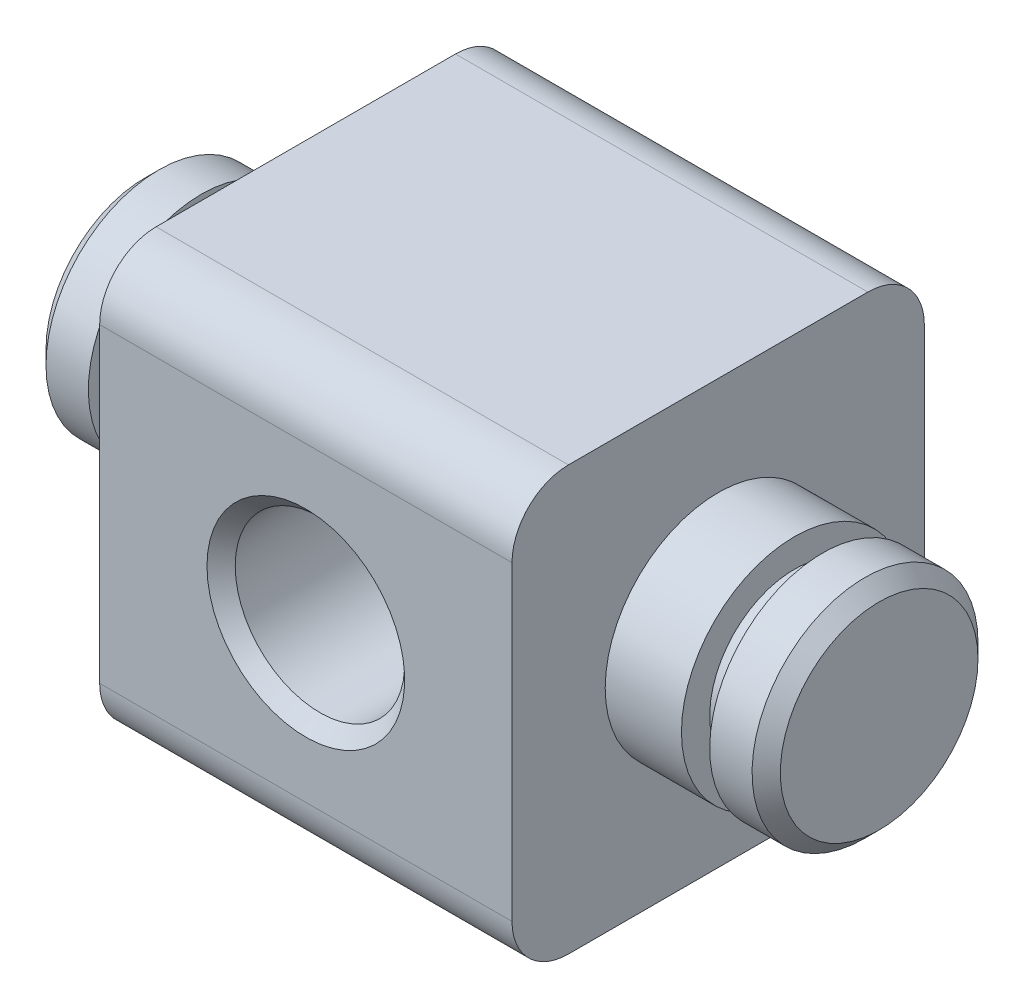
ISO-10303-21;
HEADER;
FILE_DESCRIPTION(('STEP AP214'),'2;1');
FILE_NAME('part.step','',(''),(''),'','','');
FILE_SCHEMA(('AUTOMOTIVE_DESIGN { 1 0 10303 214 1 1 1 1 }'));
ENDSEC;
DATA;
#1=APPLICATION_CONTEXT('core data for automotive mechanical design processes');
#2=APPLICATION_PROTOCOL_DEFINITION('international standard','automotive_design',2000,#1);
#3=PRODUCT_CONTEXT('',#1,'mechanical');
#4=PRODUCT('Part','Part','',(#3));
#5=PRODUCT_RELATED_PRODUCT_CATEGORY('part','',(#4));
#6=PRODUCT_DEFINITION_FORMATION('','',#4);
#7=PRODUCT_DEFINITION_CONTEXT('part definition',#1,'design');
#8=PRODUCT_DEFINITION('design','',#6,#7);
#9=PRODUCT_DEFINITION_SHAPE('','',#8);
#10=(LENGTH_UNIT() NAMED_UNIT(*) SI_UNIT(.MILLI.,.METRE.));
#11=(NAMED_UNIT(*) PLANE_ANGLE_UNIT() SI_UNIT($,.RADIAN.));
#12=(NAMED_UNIT(*) SI_UNIT($,.STERADIAN.) SOLID_ANGLE_UNIT());
#13=UNCERTAINTY_MEASURE_WITH_UNIT(LENGTH_MEASURE(1.E-05),#10,'distance_accuracy_value','');
#14=(GEOMETRIC_REPRESENTATION_CONTEXT(3) GLOBAL_UNCERTAINTY_ASSIGNED_CONTEXT((#13)) GLOBAL_UNIT_ASSIGNED_CONTEXT((#10,
#11,#12)) REPRESENTATION_CONTEXT('',''));
#15=CARTESIAN_POINT('',(0.,0.,0.));
#16=DIRECTION('',(0.,0.,1.));
#17=DIRECTION('',(1.,0.,0.));
#18=AXIS2_PLACEMENT_3D('',#15,#16,#17);
#19=CARTESIAN_POINT('',(13.,7.5,0.));
#20=DIRECTION('',(-1.,0.,0.));
#21=DIRECTION('',(0.,0.,1.));
#22=AXIS2_PLACEMENT_3D('',#19,#20,#21);
#23=CYLINDRICAL_SURFACE('',#22,4.);
#24=CARTESIAN_POINT('',(7.3,7.5,0.));
#25=DIRECTION('',(-1.,0.,0.));
#26=DIRECTION('',(0.,0.,1.));
#27=AXIS2_PLACEMENT_3D('',#24,#25,#26);
#28=CIRCLE('',#27,4.);
#29=CARTESIAN_POINT('',(7.3,7.5,4.));
#30=VERTEX_POINT('',#29);
#31=EDGE_CURVE('E207',#30,#30,#28,.T.);
#32=ORIENTED_EDGE('',*,*,#31,.F.);
#33=EDGE_LOOP('',(#32));
#34=FACE_BOUND('',#33,.T.);
#35=CARTESIAN_POINT('',(10.,7.5,0.));
#36=DIRECTION('',(1.,0.,0.));
#37=DIRECTION('',(0.,1.,0.));
#38=AXIS2_PLACEMENT_3D('',#35,#36,#37);
#39=CIRCLE('',#38,4.);
#40=CARTESIAN_POINT('',(10.,11.5,0.));
#41=VERTEX_POINT('',#40);
#42=EDGE_CURVE('E201',#41,#41,#39,.F.);
#43=ORIENTED_EDGE('',*,*,#42,.T.);
#44=EDGE_LOOP('',(#43));
#45=FACE_BOUND('',#44,.T.);
#46=ADVANCED_FACE('F34',(#34,#45),#23,.T.);
#47=CARTESIAN_POINT('',(-13.,7.5,0.));
#48=DIRECTION('',(1.,0.,0.));
#49=DIRECTION('',(0.,0.,-1.));
#50=AXIS2_PLACEMENT_3D('',#47,#48,#49);
#51=CYLINDRICAL_SURFACE('',#50,4.);
#52=CARTESIAN_POINT('',(-7.3,7.5,0.));
#53=DIRECTION('',(-1.,0.,0.));
#54=DIRECTION('',(0.,0.,1.));
#55=AXIS2_PLACEMENT_3D('',#52,#53,#54);
#56=CIRCLE('',#55,4.);
#57=CARTESIAN_POINT('',(-7.3,7.5,4.));
#58=VERTEX_POINT('',#57);
#59=EDGE_CURVE('E188',#58,#58,#56,.T.);
#60=ORIENTED_EDGE('',*,*,#59,.T.);
#61=EDGE_LOOP('',(#60));
#62=FACE_BOUND('',#61,.T.);
#63=CARTESIAN_POINT('',(-10.,7.5,0.));
#64=DIRECTION('',(-1.,0.,0.));
#65=DIRECTION('',(0.,-1.,0.));
#66=AXIS2_PLACEMENT_3D('',#63,#64,#65);
#67=CIRCLE('',#66,4.);
#68=CARTESIAN_POINT('',(-10.,3.5,0.));
#69=VERTEX_POINT('',#68);
#70=EDGE_CURVE('E189',#69,#69,#67,.T.);
#71=ORIENTED_EDGE('',*,*,#70,.F.);
#72=EDGE_LOOP('',(#71));
#73=FACE_BOUND('',#72,.T.);
#74=ADVANCED_FACE('F231',(#62,#73),#51,.T.);
#75=CARTESIAN_POINT('',(-7.3,15.,7.3));
#76=DIRECTION('',(1.,0.,0.));
#77=DIRECTION('',(0.,0.,-1.));
#78=AXIS2_PLACEMENT_3D('',#75,#76,#77);
#79=PLANE('',#78);
#80=ORIENTED_EDGE('',*,*,#59,.F.);
#81=EDGE_LOOP('',(#80));
#82=FACE_BOUND('',#81,.T.);
#83=DIRECTION('',(0.,-1.,0.));
#84=VECTOR('',#83,1.);
#85=CARTESIAN_POINT('',(-7.3,15.,-7.3));
#86=LINE('',#85,#84);
#87=CARTESIAN_POINT('',(-7.3,13.,-7.3));
#88=VERTEX_POINT('',#87);
#89=CARTESIAN_POINT('',(-7.3,2.,-7.3));
#90=VERTEX_POINT('',#89);
#91=EDGE_CURVE('E104',#88,#90,#86,.T.);
#92=ORIENTED_EDGE('',*,*,#91,.T.);
#93=CARTESIAN_POINT('',(-7.3,2.,-5.3));
#94=DIRECTION('',(1.,0.,0.));
#95=DIRECTION('',(0.,0.,-1.));
#96=AXIS2_PLACEMENT_3D('',#93,#94,#95);
#97=CIRCLE('',#96,2.);
#98=CARTESIAN_POINT('',(-7.3,0.,-5.3));
#99=VERTEX_POINT('',#98);
#100=EDGE_CURVE('E137',#90,#99,#97,.F.);
#101=ORIENTED_EDGE('',*,*,#100,.T.);
#102=DIRECTION('',(0.,0.,1.));
#103=VECTOR('',#102,1.);
#104=CARTESIAN_POINT('',(-7.3,0.,7.3));
#105=LINE('',#104,#103);
#106=CARTESIAN_POINT('',(-7.3,0.,5.3));
#107=VERTEX_POINT('',#106);
#108=EDGE_CURVE('E165',#99,#107,#105,.T.);
#109=ORIENTED_EDGE('',*,*,#108,.T.);
#110=CARTESIAN_POINT('',(-7.3,2.,5.3));
#111=DIRECTION('',(1.,0.,0.));
#112=DIRECTION('',(0.,0.,-1.));
#113=AXIS2_PLACEMENT_3D('',#110,#111,#112);
#114=CIRCLE('',#113,2.);
#115=CARTESIAN_POINT('',(-7.3,2.,7.3));
#116=VERTEX_POINT('',#115);
#117=EDGE_CURVE('E110',#107,#116,#114,.F.);
#118=ORIENTED_EDGE('',*,*,#117,.T.);
#119=DIRECTION('',(0.,-1.,0.));
#120=VECTOR('',#119,1.);
#121=CARTESIAN_POINT('',(-7.3,15.,7.3));
#122=LINE('',#121,#120);
#123=CARTESIAN_POINT('',(-7.3,13.,7.3));
#124=VERTEX_POINT('',#123);
#125=EDGE_CURVE('E173',#124,#116,#122,.T.);
#126=ORIENTED_EDGE('',*,*,#125,.F.);
#127=CARTESIAN_POINT('',(-7.3,13.,5.3));
#128=DIRECTION('',(1.,0.,0.));
#129=DIRECTION('',(0.,0.,-1.));
#130=AXIS2_PLACEMENT_3D('',#127,#128,#129);
#131=CIRCLE('',#130,2.);
#132=CARTESIAN_POINT('',(-7.3,15.,5.3));
#133=VERTEX_POINT('',#132);
#134=EDGE_CURVE('E111',#124,#133,#131,.F.);
#135=ORIENTED_EDGE('',*,*,#134,.T.);
#136=DIRECTION('',(0.,0.,1.));
#137=VECTOR('',#136,1.);
#138=CARTESIAN_POINT('',(-7.3,15.,7.3));
#139=LINE('',#138,#137);
#140=CARTESIAN_POINT('',(-7.3,15.,-5.3));
#141=VERTEX_POINT('',#140);
#142=EDGE_CURVE('E106',#141,#133,#139,.T.);
#143=ORIENTED_EDGE('',*,*,#142,.F.);
#144=CARTESIAN_POINT('',(-7.3,13.,-5.3));
#145=DIRECTION('',(1.,0.,0.));
#146=DIRECTION('',(0.,0.,-1.));
#147=AXIS2_PLACEMENT_3D('',#144,#145,#146);
#148=CIRCLE('',#147,2.);
#149=EDGE_CURVE('E101',#141,#88,#148,.F.);
#150=ORIENTED_EDGE('',*,*,#149,.T.);
#151=EDGE_LOOP('',(#92,#101,#109,#118,#126,#135,#143,#150));
#152=FACE_BOUND('',#151,.T.);
#153=ADVANCED_FACE('F103',(#82,#152),#79,.F.);
#154=CARTESIAN_POINT('',(7.3,15.,7.3));
#155=DIRECTION('',(0.,0.,-1.));
#156=DIRECTION('',(-1.,0.,0.));
#157=AXIS2_PLACEMENT_3D('',#154,#155,#156);
#158=PLANE('',#157);
#159=CARTESIAN_POINT('',(0.,7.5,7.3));
#160=DIRECTION('',(0.,0.,-1.));
#161=DIRECTION('',(-1.,0.,0.));
#162=AXIS2_PLACEMENT_3D('',#159,#160,#161);
#163=CIRCLE('',#162,3.5);
#164=CARTESIAN_POINT('',(-3.5,7.5,7.3));
#165=VERTEX_POINT('',#164);
#166=EDGE_CURVE('E185',#165,#165,#163,.T.);
#167=ORIENTED_EDGE('',*,*,#166,.T.);
#168=EDGE_LOOP('',(#167));
#169=FACE_BOUND('',#168,.T.);
#170=ORIENTED_EDGE('',*,*,#125,.T.);
#171=DIRECTION('',(1.,0.,0.));
#172=VECTOR('',#171,1.);
#173=CARTESIAN_POINT('',(7.3,2.,7.3));
#174=LINE('',#173,#172);
#175=CARTESIAN_POINT('',(7.3,2.,7.3));
#176=VERTEX_POINT('',#175);
#177=EDGE_CURVE('E150',#116,#176,#174,.T.);
#178=ORIENTED_EDGE('',*,*,#177,.T.);
#179=DIRECTION('',(0.,-1.,0.));
#180=VECTOR('',#179,1.);
#181=CARTESIAN_POINT('',(7.3,15.,7.3));
#182=LINE('',#181,#180);
#183=CARTESIAN_POINT('',(7.3,13.,7.3));
#184=VERTEX_POINT('',#183);
#185=EDGE_CURVE('E171',#184,#176,#182,.T.);
#186=ORIENTED_EDGE('',*,*,#185,.F.);
#187=DIRECTION('',(1.,0.,0.));
#188=VECTOR('',#187,1.);
#189=CARTESIAN_POINT('',(-7.3,13.,7.3));
#190=LINE('',#189,#188);
#191=EDGE_CURVE('E148',#184,#124,#190,.F.);
#192=ORIENTED_EDGE('',*,*,#191,.T.);
#193=EDGE_LOOP('',(#170,#178,#186,#192));
#194=FACE_BOUND('',#193,.T.);
#195=ADVANCED_FACE('F280',(#169,#194),#158,.F.);
#196=CARTESIAN_POINT('',(7.3,15.,7.3));
#197=DIRECTION('',(-1.,0.,0.));
#198=DIRECTION('',(0.,0.,1.));
#199=AXIS2_PLACEMENT_3D('',#196,#197,#198);
#200=PLANE('',#199);
#201=ORIENTED_EDGE('',*,*,#31,.T.);
#202=EDGE_LOOP('',(#201));
#203=FACE_BOUND('',#202,.T.);
#204=DIRECTION('',(0.,0.,-1.));
#205=VECTOR('',#204,1.);
#206=CARTESIAN_POINT('',(7.3,0.,7.3));
#207=LINE('',#206,#205);
#208=CARTESIAN_POINT('',(7.3,0.,5.3));
#209=VERTEX_POINT('',#208);
#210=CARTESIAN_POINT('',(7.3,0.,-5.3));
#211=VERTEX_POINT('',#210);
#212=EDGE_CURVE('E161',#209,#211,#207,.T.);
#213=ORIENTED_EDGE('',*,*,#212,.T.);
#214=CARTESIAN_POINT('',(7.3,2.,-5.3));
#215=DIRECTION('',(-1.,0.,0.));
#216=DIRECTION('',(0.,0.,1.));
#217=AXIS2_PLACEMENT_3D('',#214,#215,#216);
#218=CIRCLE('',#217,2.);
#219=CARTESIAN_POINT('',(7.3,2.,-7.3));
#220=VERTEX_POINT('',#219);
#221=EDGE_CURVE('E146',#211,#220,#218,.F.);
#222=ORIENTED_EDGE('',*,*,#221,.T.);
#223=DIRECTION('',(0.,-1.,0.));
#224=VECTOR('',#223,1.);
#225=CARTESIAN_POINT('',(7.3,15.,-7.3));
#226=LINE('',#225,#224);
#227=CARTESIAN_POINT('',(7.3,13.,-7.3));
#228=VERTEX_POINT('',#227);
#229=EDGE_CURVE('E121',#228,#220,#226,.T.);
#230=ORIENTED_EDGE('',*,*,#229,.F.);
#231=CARTESIAN_POINT('',(7.3,13.,-5.3));
#232=DIRECTION('',(-1.,0.,0.));
#233=DIRECTION('',(0.,0.,1.));
#234=AXIS2_PLACEMENT_3D('',#231,#232,#233);
#235=CIRCLE('',#234,2.);
#236=CARTESIAN_POINT('',(7.3,15.,-5.3));
#237=VERTEX_POINT('',#236);
#238=EDGE_CURVE('E126',#228,#237,#235,.F.);
#239=ORIENTED_EDGE('',*,*,#238,.T.);
#240=DIRECTION('',(0.,0.,-1.));
#241=VECTOR('',#240,1.);
#242=CARTESIAN_POINT('',(7.3,15.,7.3));
#243=LINE('',#242,#241);
#244=CARTESIAN_POINT('',(7.3,15.,5.3));
#245=VERTEX_POINT('',#244);
#246=EDGE_CURVE('E122',#245,#237,#243,.T.);
#247=ORIENTED_EDGE('',*,*,#246,.F.);
#248=CARTESIAN_POINT('',(7.3,13.,5.3));
#249=DIRECTION('',(-1.,0.,0.));
#250=DIRECTION('',(0.,0.,1.));
#251=AXIS2_PLACEMENT_3D('',#248,#249,#250);
#252=CIRCLE('',#251,2.);
#253=EDGE_CURVE('E57',#245,#184,#252,.F.);
#254=ORIENTED_EDGE('',*,*,#253,.T.);
#255=ORIENTED_EDGE('',*,*,#185,.T.);
#256=CARTESIAN_POINT('',(7.3,2.,5.3));
#257=DIRECTION('',(-1.,0.,0.));
#258=DIRECTION('',(0.,0.,1.));
#259=AXIS2_PLACEMENT_3D('',#256,#257,#258);
#260=CIRCLE('',#259,2.);
#261=EDGE_CURVE('E49',#176,#209,#260,.F.);
#262=ORIENTED_EDGE('',*,*,#261,.T.);
#263=EDGE_LOOP('',(#213,#222,#230,#239,#247,#254,#255,#262));
#264=FACE_BOUND('',#263,.T.);
#265=ADVANCED_FACE('F159',(#203,#264),#200,.F.);
#266=CARTESIAN_POINT('',(7.3,15.,-7.3));
#267=DIRECTION('',(0.,0.,1.));
#268=DIRECTION('',(1.,0.,0.));
#269=AXIS2_PLACEMENT_3D('',#266,#267,#268);
#270=PLANE('',#269);
#271=CARTESIAN_POINT('',(0.,7.5,-7.3));
#272=DIRECTION('',(0.,0.,1.));
#273=DIRECTION('',(1.,0.,0.));
#274=AXIS2_PLACEMENT_3D('',#271,#272,#273);
#275=CIRCLE('',#274,3.5);
#276=CARTESIAN_POINT('',(3.5,7.5,-7.3));
#277=VERTEX_POINT('',#276);
#278=EDGE_CURVE('E176',#277,#277,#275,.T.);
#279=ORIENTED_EDGE('',*,*,#278,.T.);
#280=EDGE_LOOP('',(#279));
#281=FACE_BOUND('',#280,.T.);
#282=ORIENTED_EDGE('',*,*,#229,.T.);
#283=DIRECTION('',(-1.,0.,0.));
#284=VECTOR('',#283,1.);
#285=CARTESIAN_POINT('',(7.3,2.,-7.3));
#286=LINE('',#285,#284);
#287=EDGE_CURVE('E120',#220,#90,#286,.T.);
#288=ORIENTED_EDGE('',*,*,#287,.T.);
#289=ORIENTED_EDGE('',*,*,#91,.F.);
#290=DIRECTION('',(-1.,0.,0.));
#291=VECTOR('',#290,1.);
#292=CARTESIAN_POINT('',(7.3,13.,-7.3));
#293=LINE('',#292,#291);
#294=EDGE_CURVE('E117',#88,#228,#293,.F.);
#295=ORIENTED_EDGE('',*,*,#294,.T.);
#296=EDGE_LOOP('',(#282,#288,#289,#295));
#297=FACE_BOUND('',#296,.T.);
#298=ADVANCED_FACE('F116',(#281,#297),#270,.F.);
#299=CARTESIAN_POINT('',(0.,15.,0.));
#300=DIRECTION('',(0.,1.,0.));
#301=DIRECTION('',(0.,0.,1.));
#302=AXIS2_PLACEMENT_3D('',#299,#300,#301);
#303=PLANE('',#302);
#304=ORIENTED_EDGE('',*,*,#246,.T.);
#305=DIRECTION('',(-1.,0.,0.));
#306=VECTOR('',#305,1.);
#307=CARTESIAN_POINT('',(-7.3,15.,-5.3));
#308=LINE('',#307,#306);
#309=EDGE_CURVE('E11',#237,#141,#308,.T.);
#310=ORIENTED_EDGE('',*,*,#309,.T.);
#311=ORIENTED_EDGE('',*,*,#142,.T.);
#312=DIRECTION('',(1.,0.,0.));
#313=VECTOR('',#312,1.);
#314=CARTESIAN_POINT('',(7.3,15.,5.3));
#315=LINE('',#314,#313);
#316=EDGE_CURVE('E42',#133,#245,#315,.T.);
#317=ORIENTED_EDGE('',*,*,#316,.T.);
#318=EDGE_LOOP('',(#304,#310,#311,#317));
#319=FACE_BOUND('',#318,.T.);
#320=ADVANCED_FACE('F155',(#319),#303,.T.);
#321=CARTESIAN_POINT('',(0.,0.,0.));
#322=DIRECTION('',(0.,1.,0.));
#323=DIRECTION('',(0.,0.,1.));
#324=AXIS2_PLACEMENT_3D('',#321,#322,#323);
#325=PLANE('',#324);
#326=ORIENTED_EDGE('',*,*,#108,.F.);
#327=DIRECTION('',(-1.,0.,0.));
#328=VECTOR('',#327,1.);
#329=CARTESIAN_POINT('',(0.,0.,-5.3));
#330=LINE('',#329,#328);
#331=EDGE_CURVE('E141',#99,#211,#330,.F.);
#332=ORIENTED_EDGE('',*,*,#331,.T.);
#333=ORIENTED_EDGE('',*,*,#212,.F.);
#334=DIRECTION('',(1.,0.,0.));
#335=VECTOR('',#334,1.);
#336=CARTESIAN_POINT('',(0.,0.,5.3));
#337=LINE('',#336,#335);
#338=EDGE_CURVE('E139',#209,#107,#337,.F.);
#339=ORIENTED_EDGE('',*,*,#338,.T.);
#340=EDGE_LOOP('',(#326,#332,#333,#339));
#341=FACE_BOUND('',#340,.T.);
#342=ADVANCED_FACE('F268',(#341),#325,.F.);
#343=CARTESIAN_POINT('',(0.,7.5,7.3));
#344=DIRECTION('',(0.,0.,-1.));
#345=DIRECTION('',(-1.,0.,0.));
#346=AXIS2_PLACEMENT_3D('',#343,#344,#345);
#347=CYLINDRICAL_SURFACE('',#346,3.);
#348=CARTESIAN_POINT('',(0.,7.5,-6.8));
#349=DIRECTION('',(0.,0.,1.));
#350=DIRECTION('',(1.,0.,0.));
#351=AXIS2_PLACEMENT_3D('',#348,#349,#350);
#352=CIRCLE('',#351,3.);
#353=CARTESIAN_POINT('',(3.,7.5,-6.8));
#354=VERTEX_POINT('',#353);
#355=EDGE_CURVE('E182',#354,#354,#352,.F.);
#356=ORIENTED_EDGE('',*,*,#355,.T.);
#357=EDGE_LOOP('',(#356));
#358=FACE_BOUND('',#357,.T.);
#359=CARTESIAN_POINT('',(0.,7.5,6.80000000000001));
#360=DIRECTION('',(0.,0.,-1.));
#361=DIRECTION('',(-1.,0.,0.));
#362=AXIS2_PLACEMENT_3D('',#359,#360,#361);
#363=CIRCLE('',#362,3.);
#364=CARTESIAN_POINT('',(-3.,7.5,6.80000000000001));
#365=VERTEX_POINT('',#364);
#366=EDGE_CURVE('E179',#365,#365,#363,.F.);
#367=ORIENTED_EDGE('',*,*,#366,.T.);
#368=EDGE_LOOP('',(#367));
#369=FACE_BOUND('',#368,.T.);
#370=ADVANCED_FACE('F264',(#358,#369),#347,.F.);
#371=CARTESIAN_POINT('',(0.,7.5,-7.3));
#372=DIRECTION('',(0.,0.,-1.));
#373=DIRECTION('',(-1.,0.,0.));
#374=AXIS2_PLACEMENT_3D('',#371,#372,#373);
#375=CONICAL_SURFACE('',#374,3.5,0.785398163397447);
#376=ORIENTED_EDGE('',*,*,#355,.F.);
#377=EDGE_LOOP('',(#376));
#378=FACE_BOUND('',#377,.T.);
#379=ORIENTED_EDGE('',*,*,#278,.F.);
#380=EDGE_LOOP('',(#379));
#381=FACE_BOUND('',#380,.T.);
#382=ADVANCED_FACE('F267',(#378,#381),#375,.F.);
#383=CARTESIAN_POINT('',(0.,7.5,6.80000000000001));
#384=DIRECTION('',(0.,0.,1.));
#385=DIRECTION('',(1.,0.,0.));
#386=AXIS2_PLACEMENT_3D('',#383,#384,#385);
#387=CONICAL_SURFACE('',#386,3.,0.785398163397455);
#388=ORIENTED_EDGE('',*,*,#166,.F.);
#389=EDGE_LOOP('',(#388));
#390=FACE_BOUND('',#389,.T.);
#391=ORIENTED_EDGE('',*,*,#366,.F.);
#392=EDGE_LOOP('',(#391));
#393=FACE_BOUND('',#392,.T.);
#394=ADVANCED_FACE('F256',(#390,#393),#387,.F.);
#395=CARTESIAN_POINT('',(-11.,12.2782685349081,0.));
#396=DIRECTION('',(1.,0.,0.));
#397=DIRECTION('',(0.,1.,0.));
#398=AXIS2_PLACEMENT_3D('',#395,#396,#397);
#399=PLANE('',#398);
#400=CARTESIAN_POINT('',(-11.,7.5,0.));
#401=DIRECTION('',(-1.,0.,0.));
#402=DIRECTION('',(0.,-1.,0.));
#403=AXIS2_PLACEMENT_3D('',#400,#401,#402);
#404=CIRCLE('',#403,3.);
#405=CARTESIAN_POINT('',(-11.,4.5,0.));
#406=VERTEX_POINT('',#405);
#407=EDGE_CURVE('E192',#406,#406,#404,.T.);
#408=ORIENTED_EDGE('',*,*,#407,.T.);
#409=EDGE_LOOP('',(#408));
#410=FACE_BOUND('',#409,.T.);
#411=CARTESIAN_POINT('',(-11.,7.5,0.));
#412=DIRECTION('',(1.,0.,0.));
#413=DIRECTION('',(0.,1.,0.));
#414=AXIS2_PLACEMENT_3D('',#411,#412,#413);
#415=CIRCLE('',#414,4.);
#416=CARTESIAN_POINT('',(-11.,11.5,0.));
#417=VERTEX_POINT('',#416);
#418=EDGE_CURVE('E168',#417,#417,#415,.T.);
#419=ORIENTED_EDGE('',*,*,#418,.T.);
#420=EDGE_LOOP('',(#419));
#421=FACE_BOUND('',#420,.T.);
#422=ADVANCED_FACE('F248',(#410,#421),#399,.T.);
#423=CARTESIAN_POINT('',(-10.,12.2782685349081,0.));
#424=DIRECTION('',(-1.,0.,0.));
#425=DIRECTION('',(0.,-1.,0.));
#426=AXIS2_PLACEMENT_3D('',#423,#424,#425);
#427=PLANE('',#426);
#428=CARTESIAN_POINT('',(-10.,7.5,0.));
#429=DIRECTION('',(-1.,0.,0.));
#430=DIRECTION('',(0.,-1.,0.));
#431=AXIS2_PLACEMENT_3D('',#428,#429,#430);
#432=CIRCLE('',#431,3.);
#433=CARTESIAN_POINT('',(-10.,4.5,0.));
#434=VERTEX_POINT('',#433);
#435=EDGE_CURVE('E333',#434,#434,#432,.T.);
#436=ORIENTED_EDGE('',*,*,#435,.F.);
#437=EDGE_LOOP('',(#436));
#438=FACE_BOUND('',#437,.T.);
#439=ORIENTED_EDGE('',*,*,#70,.T.);
#440=EDGE_LOOP('',(#439));
#441=FACE_BOUND('',#440,.T.);
#442=ADVANCED_FACE('F244',(#438,#441),#427,.T.);
#443=CARTESIAN_POINT('',(-13.,7.5,0.));
#444=DIRECTION('',(-1.,0.,0.));
#445=DIRECTION('',(0.,-1.,0.));
#446=AXIS2_PLACEMENT_3D('',#443,#444,#445);
#447=CYLINDRICAL_SURFACE('',#446,3.);
#448=ORIENTED_EDGE('',*,*,#435,.T.);
#449=EDGE_LOOP('',(#448));
#450=FACE_BOUND('',#449,.T.);
#451=ORIENTED_EDGE('',*,*,#407,.F.);
#452=EDGE_LOOP('',(#451));
#453=FACE_BOUND('',#452,.T.);
#454=ADVANCED_FACE('F247',(#450,#453),#447,.T.);
#455=CARTESIAN_POINT('',(-13.,7.5,0.));
#456=DIRECTION('',(-1.,0.,0.));
#457=DIRECTION('',(0.,0.,1.));
#458=AXIS2_PLACEMENT_3D('',#455,#456,#457);
#459=PLANE('',#458);
#460=CARTESIAN_POINT('',(-13.,7.5,0.));
#461=DIRECTION('',(-1.,0.,0.));
#462=DIRECTION('',(0.,0.,1.));
#463=AXIS2_PLACEMENT_3D('',#460,#461,#462);
#464=CIRCLE('',#463,3.5);
#465=CARTESIAN_POINT('',(-13.,7.5,3.5));
#466=VERTEX_POINT('',#465);
#467=EDGE_CURVE('E195',#466,#466,#464,.T.);
#468=ORIENTED_EDGE('',*,*,#467,.T.);
#469=EDGE_LOOP('',(#468));
#470=FACE_BOUND('',#469,.T.);
#471=ADVANCED_FACE('F252',(#470),#459,.T.);
#472=CARTESIAN_POINT('',(-12.5,7.5,0.));
#473=DIRECTION('',(-1.,0.,0.));
#474=DIRECTION('',(0.,0.,1.));
#475=AXIS2_PLACEMENT_3D('',#472,#473,#474);
#476=CIRCLE('',#475,4.);
#477=CARTESIAN_POINT('',(-12.5,7.5,4.));
#478=VERTEX_POINT('',#477);
#479=EDGE_CURVE('E198',#478,#478,#476,.F.);
#480=ORIENTED_EDGE('',*,*,#479,.T.);
#481=EDGE_LOOP('',(#480));
#482=FACE_BOUND('',#481,.T.);
#483=ORIENTED_EDGE('',*,*,#418,.F.);
#484=EDGE_LOOP('',(#483));
#485=FACE_BOUND('',#484,.T.);
#486=ADVANCED_FACE('F238',(#482,#485),#51,.T.);
#487=CARTESIAN_POINT('',(-13.,7.5,0.));
#488=DIRECTION('',(1.,0.,0.));
#489=DIRECTION('',(0.,0.,-1.));
#490=AXIS2_PLACEMENT_3D('',#487,#488,#489);
#491=CONICAL_SURFACE('',#490,3.5,0.785398163397447);
#492=ORIENTED_EDGE('',*,*,#479,.F.);
#493=EDGE_LOOP('',(#492));
#494=FACE_BOUND('',#493,.T.);
#495=ORIENTED_EDGE('',*,*,#467,.F.);
#496=EDGE_LOOP('',(#495));
#497=FACE_BOUND('',#496,.T.);
#498=ADVANCED_FACE('F262',(#494,#497),#491,.T.);
#499=CARTESIAN_POINT('',(11.,12.2782685349081,0.));
#500=DIRECTION('',(-1.,0.,0.));
#501=DIRECTION('',(0.,1.,0.));
#502=AXIS2_PLACEMENT_3D('',#499,#500,#501);
#503=PLANE('',#502);
#504=CARTESIAN_POINT('',(11.,7.5,0.));
#505=DIRECTION('',(-1.,0.,0.));
#506=DIRECTION('',(0.,-1.,0.));
#507=AXIS2_PLACEMENT_3D('',#504,#505,#506);
#508=CIRCLE('',#507,4.);
#509=CARTESIAN_POINT('',(11.,3.5,0.));
#510=VERTEX_POINT('',#509);
#511=EDGE_CURVE('E204',#510,#510,#508,.F.);
#512=ORIENTED_EDGE('',*,*,#511,.F.);
#513=EDGE_LOOP('',(#512));
#514=FACE_BOUND('',#513,.T.);
#515=CARTESIAN_POINT('',(11.,7.5,0.));
#516=DIRECTION('',(-1.,0.,0.));
#517=DIRECTION('',(0.,-1.,0.));
#518=AXIS2_PLACEMENT_3D('',#515,#516,#517);
#519=CIRCLE('',#518,3.);
#520=CARTESIAN_POINT('',(11.,4.5,0.));
#521=VERTEX_POINT('',#520);
#522=EDGE_CURVE('E205',#521,#521,#519,.T.);
#523=ORIENTED_EDGE('',*,*,#522,.F.);
#524=EDGE_LOOP('',(#523));
#525=FACE_BOUND('',#524,.T.);
#526=ADVANCED_FACE('F294',(#514,#525),#503,.T.);
#527=CARTESIAN_POINT('',(13.,7.5,0.));
#528=DIRECTION('',(1.,0.,0.));
#529=DIRECTION('',(0.,-1.,0.));
#530=AXIS2_PLACEMENT_3D('',#527,#528,#529);
#531=CYLINDRICAL_SURFACE('',#530,3.);
#532=CARTESIAN_POINT('',(10.,7.5,0.));
#533=DIRECTION('',(-1.,0.,0.));
#534=DIRECTION('',(0.,-1.,0.));
#535=AXIS2_PLACEMENT_3D('',#532,#533,#534);
#536=CIRCLE('',#535,3.);
#537=CARTESIAN_POINT('',(10.,4.5,0.));
#538=VERTEX_POINT('',#537);
#539=EDGE_CURVE('E326',#538,#538,#536,.T.);
#540=ORIENTED_EDGE('',*,*,#539,.F.);
#541=EDGE_LOOP('',(#540));
#542=FACE_BOUND('',#541,.T.);
#543=ORIENTED_EDGE('',*,*,#522,.T.);
#544=EDGE_LOOP('',(#543));
#545=FACE_BOUND('',#544,.T.);
#546=ADVANCED_FACE('F299',(#542,#545),#531,.T.);
#547=CARTESIAN_POINT('',(10.,12.2782685349081,0.));
#548=DIRECTION('',(1.,0.,0.));
#549=DIRECTION('',(0.,-1.,0.));
#550=AXIS2_PLACEMENT_3D('',#547,#548,#549);
#551=PLANE('',#550);
#552=ORIENTED_EDGE('',*,*,#42,.F.);
#553=EDGE_LOOP('',(#552));
#554=FACE_BOUND('',#553,.T.);
#555=ORIENTED_EDGE('',*,*,#539,.T.);
#556=EDGE_LOOP('',(#555));
#557=FACE_BOUND('',#556,.T.);
#558=ADVANCED_FACE('F310',(#554,#557),#551,.T.);
#559=CARTESIAN_POINT('',(13.,7.5,0.));
#560=DIRECTION('',(1.,0.,0.));
#561=DIRECTION('',(0.,0.,1.));
#562=AXIS2_PLACEMENT_3D('',#559,#560,#561);
#563=PLANE('',#562);
#564=CARTESIAN_POINT('',(13.,7.5,0.));
#565=DIRECTION('',(1.,0.,0.));
#566=DIRECTION('',(0.,0.,-1.));
#567=AXIS2_PLACEMENT_3D('',#564,#565,#566);
#568=CIRCLE('',#567,3.5);
#569=CARTESIAN_POINT('',(13.,7.5,-3.49999999999999));
#570=VERTEX_POINT('',#569);
#571=EDGE_CURVE('E127',#570,#570,#568,.T.);
#572=ORIENTED_EDGE('',*,*,#571,.T.);
#573=EDGE_LOOP('',(#572));
#574=FACE_BOUND('',#573,.T.);
#575=ADVANCED_FACE('F226',(#574),#563,.T.);
#576=CARTESIAN_POINT('',(12.5,7.5,0.));
#577=DIRECTION('',(1.,0.,0.));
#578=DIRECTION('',(0.,0.,-1.));
#579=AXIS2_PLACEMENT_3D('',#576,#577,#578);
#580=CIRCLE('',#579,4.);
#581=CARTESIAN_POINT('',(12.5,7.5,-3.99999999999999));
#582=VERTEX_POINT('',#581);
#583=EDGE_CURVE('E131',#582,#582,#580,.F.);
#584=ORIENTED_EDGE('',*,*,#583,.T.);
#585=EDGE_LOOP('',(#584));
#586=FACE_BOUND('',#585,.T.);
#587=ORIENTED_EDGE('',*,*,#511,.T.);
#588=EDGE_LOOP('',(#587));
#589=FACE_BOUND('',#588,.T.);
#590=ADVANCED_FACE('F211',(#586,#589),#23,.T.);
#591=CARTESIAN_POINT('',(12.5,7.5,0.));
#592=DIRECTION('',(-1.,0.,0.));
#593=DIRECTION('',(0.,0.,1.));
#594=AXIS2_PLACEMENT_3D('',#591,#592,#593);
#595=CONICAL_SURFACE('',#594,4.,0.78539816339745);
#596=ORIENTED_EDGE('',*,*,#571,.F.);
#597=EDGE_LOOP('',(#596));
#598=FACE_BOUND('',#597,.T.);
#599=ORIENTED_EDGE('',*,*,#583,.F.);
#600=EDGE_LOOP('',(#599));
#601=FACE_BOUND('',#600,.T.);
#602=ADVANCED_FACE('F214',(#598,#601),#595,.T.);
#603=CARTESIAN_POINT('',(7.3,2.,-5.3));
#604=DIRECTION('',(-1.,0.,0.));
#605=DIRECTION('',(0.,0.,1.));
#606=AXIS2_PLACEMENT_3D('',#603,#604,#605);
#607=CYLINDRICAL_SURFACE('',#606,2.);
#608=ORIENTED_EDGE('',*,*,#221,.F.);
#609=ORIENTED_EDGE('',*,*,#331,.F.);
#610=ORIENTED_EDGE('',*,*,#100,.F.);
#611=ORIENTED_EDGE('',*,*,#287,.F.);
#612=EDGE_LOOP('',(#608,#609,#610,#611));
#613=FACE_BOUND('',#612,.T.);
#614=ADVANCED_FACE('F216',(#613),#607,.T.);
#615=CARTESIAN_POINT('',(7.3,2.,5.3));
#616=DIRECTION('',(1.,0.,0.));
#617=DIRECTION('',(0.,0.,-1.));
#618=AXIS2_PLACEMENT_3D('',#615,#616,#617);
#619=CYLINDRICAL_SURFACE('',#618,2.);
#620=ORIENTED_EDGE('',*,*,#117,.F.);
#621=ORIENTED_EDGE('',*,*,#338,.F.);
#622=ORIENTED_EDGE('',*,*,#261,.F.);
#623=ORIENTED_EDGE('',*,*,#177,.F.);
#624=EDGE_LOOP('',(#620,#621,#622,#623));
#625=FACE_BOUND('',#624,.T.);
#626=ADVANCED_FACE('F223',(#625),#619,.T.);
#627=CARTESIAN_POINT('',(0.,13.,-5.3));
#628=DIRECTION('',(1.,0.,0.));
#629=DIRECTION('',(0.,0.,-1.));
#630=AXIS2_PLACEMENT_3D('',#627,#628,#629);
#631=CYLINDRICAL_SURFACE('',#630,2.);
#632=ORIENTED_EDGE('',*,*,#238,.F.);
#633=ORIENTED_EDGE('',*,*,#294,.F.);
#634=ORIENTED_EDGE('',*,*,#149,.F.);
#635=ORIENTED_EDGE('',*,*,#309,.F.);
#636=EDGE_LOOP('',(#632,#633,#634,#635));
#637=FACE_BOUND('',#636,.T.);
#638=ADVANCED_FACE('F125',(#637),#631,.T.);
#639=CARTESIAN_POINT('',(0.,13.,5.3));
#640=DIRECTION('',(-1.,0.,0.));
#641=DIRECTION('',(0.,0.,1.));
#642=AXIS2_PLACEMENT_3D('',#639,#640,#641);
#643=CYLINDRICAL_SURFACE('',#642,2.);
#644=ORIENTED_EDGE('',*,*,#134,.F.);
#645=ORIENTED_EDGE('',*,*,#191,.F.);
#646=ORIENTED_EDGE('',*,*,#253,.F.);
#647=ORIENTED_EDGE('',*,*,#316,.F.);
#648=EDGE_LOOP('',(#644,#645,#646,#647));
#649=FACE_BOUND('',#648,.T.);
#650=ADVANCED_FACE('F36',(#649),#643,.T.);
#651=CLOSED_SHELL('',(#46,#74,#153,#195,#265,#298,#320,#342,#370,#382,#394,#422,#442,#454,#471,
#486,#498,#526,#546,#558,#575,#590,#602,#614,#626,#638,#650));
#652=MANIFOLD_SOLID_BREP('B2',#651);
#653=ADVANCED_BREP_SHAPE_REPRESENTATION('',(#18,#652),#14);
#654=SHAPE_DEFINITION_REPRESENTATION(#9,#653);
ENDSEC;
END-ISO-10303-21;
